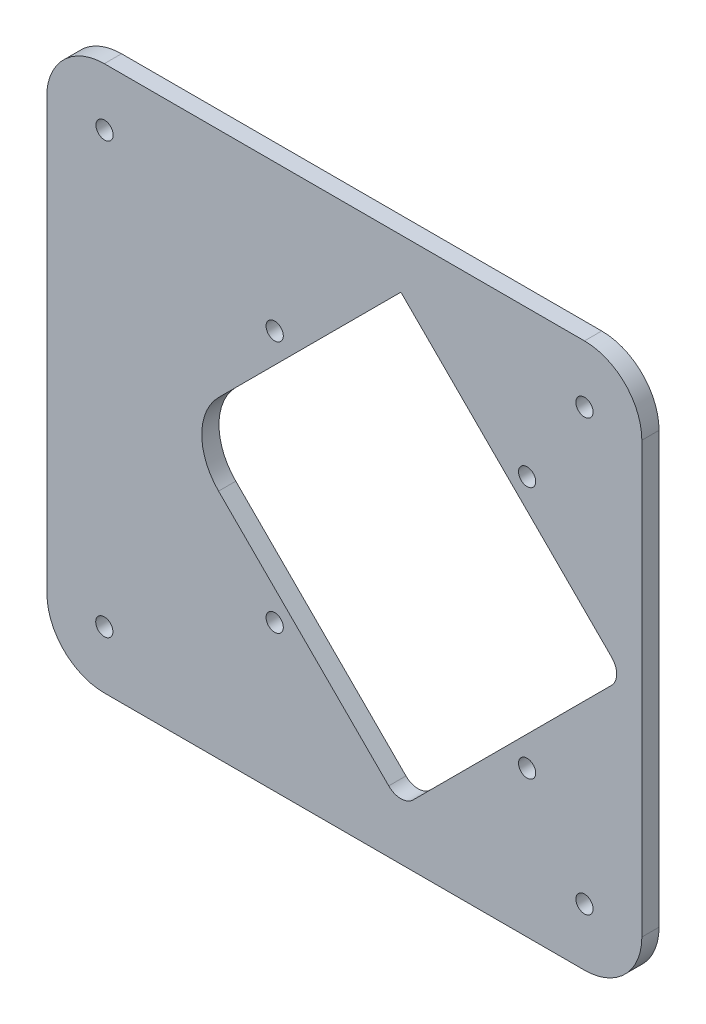
ISO-10303-21;
HEADER;
FILE_DESCRIPTION(('STEP AP214'),'2;1');
FILE_NAME('part.step','',(''),(''),'','','');
FILE_SCHEMA(('AUTOMOTIVE_DESIGN { 1 0 10303 214 1 1 1 1 }'));
ENDSEC;
DATA;
#1=APPLICATION_CONTEXT('core data for automotive mechanical design processes');
#2=APPLICATION_PROTOCOL_DEFINITION('international standard','automotive_design',2000,#1);
#3=PRODUCT_CONTEXT('',#1,'mechanical');
#4=PRODUCT('Part','Part','',(#3));
#5=PRODUCT_RELATED_PRODUCT_CATEGORY('part','',(#4));
#6=PRODUCT_DEFINITION_FORMATION('','',#4);
#7=PRODUCT_DEFINITION_CONTEXT('part definition',#1,'design');
#8=PRODUCT_DEFINITION('design','',#6,#7);
#9=PRODUCT_DEFINITION_SHAPE('','',#8);
#10=(LENGTH_UNIT() NAMED_UNIT(*) SI_UNIT(.MILLI.,.METRE.));
#11=(NAMED_UNIT(*) PLANE_ANGLE_UNIT() SI_UNIT($,.RADIAN.));
#12=(NAMED_UNIT(*) SI_UNIT($,.STERADIAN.) SOLID_ANGLE_UNIT());
#13=UNCERTAINTY_MEASURE_WITH_UNIT(LENGTH_MEASURE(1.E-05),#10,'distance_accuracy_value','');
#14=(GEOMETRIC_REPRESENTATION_CONTEXT(3) GLOBAL_UNCERTAINTY_ASSIGNED_CONTEXT((#13)) GLOBAL_UNIT_ASSIGNED_CONTEXT((#10,
#11,#12)) REPRESENTATION_CONTEXT('',''));
#15=CARTESIAN_POINT('',(0.,0.,0.));
#16=DIRECTION('',(0.,0.,1.));
#17=DIRECTION('',(1.,0.,0.));
#18=AXIS2_PLACEMENT_3D('',#15,#16,#17);
#19=CARTESIAN_POINT('',(0.,85.8158299189013,3.));
#20=DIRECTION('',(0.,-1.,0.));
#21=DIRECTION('',(1.,0.,0.));
#22=AXIS2_PLACEMENT_3D('',#19,#20,#21);
#23=PLANE('',#22);
#24=DIRECTION('',(-1.,0.,0.));
#25=VECTOR('',#24,1.);
#26=CARTESIAN_POINT('',(0.,85.8158299189013,0.));
#27=LINE('',#26,#25);
#28=CARTESIAN_POINT('',(117.267301895935,85.8158299189013,0.));
#29=VERTEX_POINT('',#28);
#30=CARTESIAN_POINT('',(33.5675872249523,85.8158299189013,0.));
#31=VERTEX_POINT('',#30);
#32=EDGE_CURVE('E226',#29,#31,#27,.T.);
#33=ORIENTED_EDGE('',*,*,#32,.T.);
#34=DIRECTION('',(0.,0.,-1.));
#35=VECTOR('',#34,1.);
#36=CARTESIAN_POINT('',(33.5675872249523,85.8158299189013,3.));
#37=LINE('',#36,#35);
#38=CARTESIAN_POINT('',(33.5675872249523,85.8158299189013,3.));
#39=VERTEX_POINT('',#38);
#40=EDGE_CURVE('E11',#39,#31,#37,.T.);
#41=ORIENTED_EDGE('',*,*,#40,.F.);
#42=DIRECTION('',(-1.,0.,0.));
#43=VECTOR('',#42,1.);
#44=CARTESIAN_POINT('',(0.,85.8158299189013,3.));
#45=LINE('',#44,#43);
#46=CARTESIAN_POINT('',(117.267301895935,85.8158299189013,3.));
#47=VERTEX_POINT('',#46);
#48=EDGE_CURVE('E324',#47,#39,#45,.T.);
#49=ORIENTED_EDGE('',*,*,#48,.F.);
#50=DIRECTION('',(0.,0.,-1.));
#51=VECTOR('',#50,1.);
#52=CARTESIAN_POINT('',(117.267301895935,85.8158299189013,3.));
#53=LINE('',#52,#51);
#54=EDGE_CURVE('E243',#47,#29,#53,.T.);
#55=ORIENTED_EDGE('',*,*,#54,.T.);
#56=EDGE_LOOP('',(#33,#41,#49,#55));
#57=FACE_BOUND('',#56,.T.);
#58=ADVANCED_FACE('F39',(#57),#23,.F.);
#59=CARTESIAN_POINT('',(33.610099884934,75.7130723533501,3.));
#60=DIRECTION('',(0.,0.,-1.));
#61=DIRECTION('',(-1.,0.,0.));
#62=AXIS2_PLACEMENT_3D('',#59,#60,#61);
#63=CYLINDRICAL_SURFACE('',#62,10.1028470123308);
#64=CARTESIAN_POINT('',(33.610099884934,75.7130723533501,0.));
#65=DIRECTION('',(0.,0.,1.));
#66=DIRECTION('',(1.,0.,0.));
#67=AXIS2_PLACEMENT_3D('',#64,#65,#66);
#68=CIRCLE('',#67,10.1028470123308);
#69=CARTESIAN_POINT('',(23.5676213144406,76.815860599452,0.));
#70=VERTEX_POINT('',#69);
#71=EDGE_CURVE('E229',#31,#70,#68,.T.);
#72=ORIENTED_EDGE('',*,*,#71,.T.);
#73=DIRECTION('',(0.,0.,-1.));
#74=VECTOR('',#73,1.);
#75=CARTESIAN_POINT('',(23.5676213144406,76.815860599452,3.));
#76=LINE('',#75,#74);
#77=CARTESIAN_POINT('',(23.5676213144406,76.815860599452,3.));
#78=VERTEX_POINT('',#77);
#79=EDGE_CURVE('E49',#78,#70,#76,.T.);
#80=ORIENTED_EDGE('',*,*,#79,.F.);
#81=CARTESIAN_POINT('',(33.610099884934,75.7130723533501,3.));
#82=DIRECTION('',(0.,0.,1.));
#83=DIRECTION('',(1.,0.,0.));
#84=AXIS2_PLACEMENT_3D('',#81,#82,#83);
#85=CIRCLE('',#84,10.1028470123308);
#86=EDGE_CURVE('E326',#39,#78,#85,.T.);
#87=ORIENTED_EDGE('',*,*,#86,.F.);
#88=ORIENTED_EDGE('',*,*,#40,.T.);
#89=EDGE_LOOP('',(#72,#80,#87,#88));
#90=FACE_BOUND('',#89,.T.);
#91=ADVANCED_FACE('F361',(#90),#63,.T.);
#92=CARTESIAN_POINT('',(23.5676213144406,0.,3.));
#93=DIRECTION('',(-1.,0.,0.));
#94=DIRECTION('',(0.,0.,1.));
#95=AXIS2_PLACEMENT_3D('',#92,#93,#94);
#96=PLANE('',#95);
#97=DIRECTION('',(0.,1.,0.));
#98=VECTOR('',#97,1.);
#99=CARTESIAN_POINT('',(23.5676213144406,0.,0.));
#100=LINE('',#99,#98);
#101=CARTESIAN_POINT('',(23.5676213144406,0.816119679548928,0.));
#102=VERTEX_POINT('',#101);
#103=EDGE_CURVE('E232',#102,#70,#100,.T.);
#104=ORIENTED_EDGE('',*,*,#103,.F.);
#105=DIRECTION('',(0.,0.,-1.));
#106=VECTOR('',#105,1.);
#107=CARTESIAN_POINT('',(23.5676213144406,0.816119679548928,3.));
#108=LINE('',#107,#106);
#109=CARTESIAN_POINT('',(23.5676213144406,0.816119679548928,3.));
#110=VERTEX_POINT('',#109);
#111=EDGE_CURVE('E250',#110,#102,#108,.T.);
#112=ORIENTED_EDGE('',*,*,#111,.F.);
#113=DIRECTION('',(0.,1.,0.));
#114=VECTOR('',#113,1.);
#115=CARTESIAN_POINT('',(23.5676213144406,0.,3.));
#116=LINE('',#115,#114);
#117=EDGE_CURVE('E328',#110,#78,#116,.T.);
#118=ORIENTED_EDGE('',*,*,#117,.T.);
#119=ORIENTED_EDGE('',*,*,#79,.T.);
#120=EDGE_LOOP('',(#104,#112,#118,#119));
#121=FACE_BOUND('',#120,.T.);
#122=ADVANCED_FACE('F366',(#121),#96,.T.);
#123=CARTESIAN_POINT('',(33.5676480380997,0.816180492699436,3.));
#124=DIRECTION('',(0.,0.,-1.));
#125=DIRECTION('',(-1.,0.,0.));
#126=AXIS2_PLACEMENT_3D('',#123,#124,#125);
#127=CYLINDRICAL_SURFACE('',#126,10.000026723844);
#128=CARTESIAN_POINT('',(33.5676480380997,0.816180492699436,0.));
#129=DIRECTION('',(0.,0.,1.));
#130=DIRECTION('',(1.,0.,0.));
#131=AXIS2_PLACEMENT_3D('',#128,#129,#130);
#132=CIRCLE('',#131,10.000026723844);
#133=CARTESIAN_POINT('',(33.5676480380997,-9.18384623114456,0.));
#134=VERTEX_POINT('',#133);
#135=EDGE_CURVE('E235',#102,#134,#132,.T.);
#136=ORIENTED_EDGE('',*,*,#135,.T.);
#137=DIRECTION('',(0.,0.,-1.));
#138=VECTOR('',#137,1.);
#139=CARTESIAN_POINT('',(33.5676480380997,-9.18384623114456,3.));
#140=LINE('',#139,#138);
#141=CARTESIAN_POINT('',(33.5676480380997,-9.18384623114456,3.));
#142=VERTEX_POINT('',#141);
#143=EDGE_CURVE('E247',#142,#134,#140,.T.);
#144=ORIENTED_EDGE('',*,*,#143,.F.);
#145=CARTESIAN_POINT('',(33.5676480380997,0.816180492699436,3.));
#146=DIRECTION('',(0.,0.,1.));
#147=DIRECTION('',(1.,0.,0.));
#148=AXIS2_PLACEMENT_3D('',#145,#146,#147);
#149=CIRCLE('',#148,10.000026723844);
#150=EDGE_CURVE('E331',#110,#142,#149,.T.);
#151=ORIENTED_EDGE('',*,*,#150,.F.);
#152=ORIENTED_EDGE('',*,*,#111,.T.);
#153=EDGE_LOOP('',(#136,#144,#151,#152));
#154=FACE_BOUND('',#153,.T.);
#155=ADVANCED_FACE('F336',(#154),#127,.T.);
#156=CARTESIAN_POINT('',(0.,-9.18384623114454,3.));
#157=DIRECTION('',(0.,1.,0.));
#158=DIRECTION('',(-1.,0.,0.));
#159=AXIS2_PLACEMENT_3D('',#156,#157,#158);
#160=PLANE('',#159);
#161=DIRECTION('',(1.,0.,0.));
#162=VECTOR('',#161,1.);
#163=CARTESIAN_POINT('',(0.,-9.18384623114454,0.));
#164=LINE('',#163,#162);
#165=CARTESIAN_POINT('',(117.267301895935,-9.1838462311446,0.));
#166=VERTEX_POINT('',#165);
#167=EDGE_CURVE('E237',#134,#166,#164,.T.);
#168=ORIENTED_EDGE('',*,*,#167,.T.);
#169=DIRECTION('',(0.,0.,-1.));
#170=VECTOR('',#169,1.);
#171=CARTESIAN_POINT('',(117.267301895935,-9.1838462311446,3.));
#172=LINE('',#171,#170);
#173=CARTESIAN_POINT('',(117.267301895935,-9.1838462311446,3.));
#174=VERTEX_POINT('',#173);
#175=EDGE_CURVE('E172',#174,#166,#172,.T.);
#176=ORIENTED_EDGE('',*,*,#175,.F.);
#177=DIRECTION('',(1.,0.,0.));
#178=VECTOR('',#177,1.);
#179=CARTESIAN_POINT('',(0.,-9.18384623114454,3.));
#180=LINE('',#179,#178);
#181=EDGE_CURVE('E163',#142,#174,#180,.T.);
#182=ORIENTED_EDGE('',*,*,#181,.F.);
#183=ORIENTED_EDGE('',*,*,#143,.T.);
#184=EDGE_LOOP('',(#168,#176,#182,#183));
#185=FACE_BOUND('',#184,.T.);
#186=ADVANCED_FACE('F340',(#185),#160,.F.);
#187=CARTESIAN_POINT('',(117.267226437662,0.816095137726306,3.));
#188=DIRECTION('',(0.,0.,-1.));
#189=DIRECTION('',(-1.,0.,0.));
#190=AXIS2_PLACEMENT_3D('',#187,#188,#189);
#191=CYLINDRICAL_SURFACE('',#190,9.99994136915558);
#192=CARTESIAN_POINT('',(117.267226437662,0.816095137726306,0.));
#193=DIRECTION('',(0.,0.,1.));
#194=DIRECTION('',(1.,0.,0.));
#195=AXIS2_PLACEMENT_3D('',#192,#193,#194);
#196=CIRCLE('',#195,9.99994136915558);
#197=CARTESIAN_POINT('',(127.267167806788,0.816119679301803,0.));
#198=VERTEX_POINT('',#197);
#199=EDGE_CURVE('E171',#166,#198,#196,.T.);
#200=ORIENTED_EDGE('',*,*,#199,.T.);
#201=DIRECTION('',(0.,0.,-1.));
#202=VECTOR('',#201,1.);
#203=CARTESIAN_POINT('',(127.267167806788,0.816119679301803,3.));
#204=LINE('',#203,#202);
#205=CARTESIAN_POINT('',(127.267167806788,0.816119679301803,3.));
#206=VERTEX_POINT('',#205);
#207=EDGE_CURVE('E168',#206,#198,#204,.T.);
#208=ORIENTED_EDGE('',*,*,#207,.F.);
#209=CARTESIAN_POINT('',(117.267226437662,0.816095137726306,3.));
#210=DIRECTION('',(0.,0.,1.));
#211=DIRECTION('',(1.,0.,0.));
#212=AXIS2_PLACEMENT_3D('',#209,#210,#211);
#213=CIRCLE('',#212,9.99994136915558);
#214=EDGE_CURVE('E157',#174,#206,#213,.T.);
#215=ORIENTED_EDGE('',*,*,#214,.F.);
#216=ORIENTED_EDGE('',*,*,#175,.T.);
#217=EDGE_LOOP('',(#200,#208,#215,#216));
#218=FACE_BOUND('',#217,.T.);
#219=ADVANCED_FACE('F169',(#218),#191,.T.);
#220=CARTESIAN_POINT('',(127.267167806788,0.,3.));
#221=DIRECTION('',(-1.,0.,0.));
#222=DIRECTION('',(0.,0.,1.));
#223=AXIS2_PLACEMENT_3D('',#220,#221,#222);
#224=PLANE('',#223);
#225=DIRECTION('',(0.,1.,0.));
#226=VECTOR('',#225,1.);
#227=CARTESIAN_POINT('',(127.267167806788,0.,0.));
#228=LINE('',#227,#226);
#229=CARTESIAN_POINT('',(127.267167806788,75.8158640080907,0.));
#230=VERTEX_POINT('',#229);
#231=EDGE_CURVE('E108',#198,#230,#228,.T.);
#232=ORIENTED_EDGE('',*,*,#231,.T.);
#233=DIRECTION('',(0.,0.,-1.));
#234=VECTOR('',#233,1.);
#235=CARTESIAN_POINT('',(127.267167806788,75.8158640080907,3.));
#236=LINE('',#235,#234);
#237=CARTESIAN_POINT('',(127.267167806788,75.8158640080907,3.));
#238=VERTEX_POINT('',#237);
#239=EDGE_CURVE('E173',#238,#230,#236,.T.);
#240=ORIENTED_EDGE('',*,*,#239,.F.);
#241=DIRECTION('',(0.,1.,0.));
#242=VECTOR('',#241,1.);
#243=CARTESIAN_POINT('',(127.267167806788,0.,3.));
#244=LINE('',#243,#242);
#245=EDGE_CURVE('E161',#206,#238,#244,.T.);
#246=ORIENTED_EDGE('',*,*,#245,.F.);
#247=ORIENTED_EDGE('',*,*,#207,.T.);
#248=EDGE_LOOP('',(#232,#240,#246,#247));
#249=FACE_BOUND('',#248,.T.);
#250=ADVANCED_FACE('F175',(#249),#224,.F.);
#251=CARTESIAN_POINT('',(60.5543400223785,38.3163723805526,3.));
#252=DIRECTION('',(0.,0.,-1.));
#253=DIRECTION('',(-1.,0.,0.));
#254=AXIS2_PLACEMENT_3D('',#251,#252,#253);
#255=CYLINDRICAL_SURFACE('',#254,9.99996591051167);
#256=CARTESIAN_POINT('',(60.5543400223785,38.3163723805526,0.));
#257=DIRECTION('',(0.,0.,1.));
#258=DIRECTION('',(1.,0.,0.));
#259=AXIS2_PLACEMENT_3D('',#256,#257,#258);
#260=CIRCLE('',#259,9.99996591051167);
#261=CARTESIAN_POINT('',(53.4832849518152,45.3874047238853,0.));
#262=VERTEX_POINT('',#261);
#263=CARTESIAN_POINT('',(53.4832849518152,31.2453400372199,0.));
#264=VERTEX_POINT('',#263);
#265=EDGE_CURVE('E181',#262,#264,#260,.T.);
#266=ORIENTED_EDGE('',*,*,#265,.F.);
#267=DIRECTION('',(0.,0.,-1.));
#268=VECTOR('',#267,1.);
#269=CARTESIAN_POINT('',(53.4832849518152,45.3874047238853,3.));
#270=LINE('',#269,#268);
#271=CARTESIAN_POINT('',(53.4832849518152,45.3874047238853,3.));
#272=VERTEX_POINT('',#271);
#273=EDGE_CURVE('E43',#272,#262,#270,.T.);
#274=ORIENTED_EDGE('',*,*,#273,.F.);
#275=CARTESIAN_POINT('',(60.5543400223785,38.3163723805526,3.));
#276=DIRECTION('',(0.,0.,1.));
#277=DIRECTION('',(1.,0.,0.));
#278=AXIS2_PLACEMENT_3D('',#275,#276,#277);
#279=CIRCLE('',#278,9.99996591051167);
#280=CARTESIAN_POINT('',(53.4832849518152,31.2453400372199,3.));
#281=VERTEX_POINT('',#280);
#282=EDGE_CURVE('E242',#272,#281,#279,.T.);
#283=ORIENTED_EDGE('',*,*,#282,.T.);
#284=DIRECTION('',(0.,0.,-1.));
#285=VECTOR('',#284,1.);
#286=CARTESIAN_POINT('',(53.4832849518152,31.2453400372199,3.));
#287=LINE('',#286,#285);
#288=EDGE_CURVE('E177',#281,#264,#287,.T.);
#289=ORIENTED_EDGE('',*,*,#288,.T.);
#290=EDGE_LOOP('',(#266,#274,#283,#289));
#291=FACE_BOUND('',#290,.T.);
#292=ADVANCED_FACE('F41',(#291),#255,.F.);
#293=CARTESIAN_POINT('',(4.04802606510993,-4.04801305426208,3.));
#294=DIRECTION('',(0.707107917551036,-0.707105644820233,0.));
#295=DIRECTION('',(0.707105644820233,0.707107917551036,0.));
#296=AXIS2_PLACEMENT_3D('',#293,#294,#295);
#297=PLANE('',#296);
#298=DIRECTION('',(-0.707105644820233,-0.707107917551036,0.));
#299=VECTOR('',#298,1.);
#300=CARTESIAN_POINT('',(4.04802606510993,-4.04801305426208,0.));
#301=LINE('',#300,#299);
#302=CARTESIAN_POINT('',(85.2674242155602,77.1716461460461,0.));
#303=VERTEX_POINT('',#302);
#304=EDGE_CURVE('E184',#303,#262,#301,.T.);
#305=ORIENTED_EDGE('',*,*,#304,.F.);
#306=DIRECTION('',(0.,0.,-1.));
#307=VECTOR('',#306,1.);
#308=CARTESIAN_POINT('',(85.2674242155602,77.1716461460461,3.));
#309=LINE('',#308,#307);
#310=CARTESIAN_POINT('',(85.2674242155602,77.1716461460461,3.));
#311=VERTEX_POINT('',#310);
#312=EDGE_CURVE('E261',#311,#303,#309,.T.);
#313=ORIENTED_EDGE('',*,*,#312,.F.);
#314=DIRECTION('',(-0.707105644820233,-0.707107917551036,0.));
#315=VECTOR('',#314,1.);
#316=CARTESIAN_POINT('',(4.04802606510993,-4.04801305426208,3.));
#317=LINE('',#316,#315);
#318=EDGE_CURVE('E270',#311,#272,#317,.T.);
#319=ORIENTED_EDGE('',*,*,#318,.T.);
#320=ORIENTED_EDGE('',*,*,#273,.T.);
#321=EDGE_LOOP('',(#305,#313,#319,#320));
#322=FACE_BOUND('',#321,.T.);
#323=ADVANCED_FACE('F268',(#322),#297,.T.);
#324=CARTESIAN_POINT('',(81.2195351808036,81.2195351808028,3.));
#325=DIRECTION('',(-0.707106781186551,-0.707106781186544,0.));
#326=DIRECTION('',(0.707106781186544,-0.707106781186551,0.));
#327=AXIS2_PLACEMENT_3D('',#324,#325,#326);
#328=PLANE('',#327);
#329=DIRECTION('',(-0.707106781186544,0.707106781186551,0.));
#330=VECTOR('',#329,1.);
#331=CARTESIAN_POINT('',(81.2195351808036,81.2195351808028,0.));
#332=LINE('',#331,#330);
#333=CARTESIAN_POINT('',(122.001384868967,40.4376854926398,0.));
#334=VERTEX_POINT('',#333);
#335=EDGE_CURVE('E187',#334,#303,#332,.T.);
#336=ORIENTED_EDGE('',*,*,#335,.F.);
#337=DIRECTION('',(0.,0.,-1.));
#338=VECTOR('',#337,1.);
#339=CARTESIAN_POINT('',(122.001384868967,40.4376854926398,3.));
#340=LINE('',#339,#338);
#341=CARTESIAN_POINT('',(122.001384868967,40.4376854926398,3.));
#342=VERTEX_POINT('',#341);
#343=EDGE_CURVE('E260',#342,#334,#340,.T.);
#344=ORIENTED_EDGE('',*,*,#343,.F.);
#345=DIRECTION('',(-0.707106781186544,0.707106781186551,0.));
#346=VECTOR('',#345,1.);
#347=CARTESIAN_POINT('',(81.2195351808036,81.2195351808028,3.));
#348=LINE('',#347,#346);
#349=EDGE_CURVE('E278',#342,#311,#348,.T.);
#350=ORIENTED_EDGE('',*,*,#349,.T.);
#351=ORIENTED_EDGE('',*,*,#312,.T.);
#352=EDGE_LOOP('',(#336,#344,#350,#351));
#353=FACE_BOUND('',#352,.T.);
#354=ADVANCED_FACE('F276',(#353),#328,.T.);
#355=CARTESIAN_POINT('',(119.880071756879,38.3163723805526,3.));
#356=DIRECTION('',(0.,0.,-1.));
#357=DIRECTION('',(-1.,0.,0.));
#358=AXIS2_PLACEMENT_3D('',#355,#356,#357);
#359=CYLINDRICAL_SURFACE('',#358,2.99998977315351);
#360=CARTESIAN_POINT('',(119.880071756879,38.3163723805526,0.));
#361=DIRECTION('',(0.,0.,1.));
#362=DIRECTION('',(1.,0.,0.));
#363=AXIS2_PLACEMENT_3D('',#360,#361,#362);
#364=CIRCLE('',#363,2.99998977315351);
#365=CARTESIAN_POINT('',(122.001384868967,36.1950592684655,0.));
#366=VERTEX_POINT('',#365);
#367=EDGE_CURVE('E190',#366,#334,#364,.T.);
#368=ORIENTED_EDGE('',*,*,#367,.F.);
#369=DIRECTION('',(0.,0.,-1.));
#370=VECTOR('',#369,1.);
#371=CARTESIAN_POINT('',(122.001384868967,36.1950592684655,3.));
#372=LINE('',#371,#370);
#373=CARTESIAN_POINT('',(122.001384868967,36.1950592684655,3.));
#374=VERTEX_POINT('',#373);
#375=EDGE_CURVE('E258',#374,#366,#372,.T.);
#376=ORIENTED_EDGE('',*,*,#375,.F.);
#377=CARTESIAN_POINT('',(119.880071756879,38.3163723805526,3.));
#378=DIRECTION('',(0.,0.,1.));
#379=DIRECTION('',(1.,0.,0.));
#380=AXIS2_PLACEMENT_3D('',#377,#378,#379);
#381=CIRCLE('',#380,2.99998977315351);
#382=EDGE_CURVE('E285',#374,#342,#381,.T.);
#383=ORIENTED_EDGE('',*,*,#382,.T.);
#384=ORIENTED_EDGE('',*,*,#343,.T.);
#385=EDGE_LOOP('',(#368,#376,#383,#384));
#386=FACE_BOUND('',#385,.T.);
#387=ADVANCED_FACE('F288',(#386),#359,.F.);
#388=CARTESIAN_POINT('',(42.9031628002506,-42.9031628002505,3.));
#389=DIRECTION('',(-0.707106781186548,0.707106781186547,0.));
#390=DIRECTION('',(-0.707106781186547,-0.707106781186548,0.));
#391=AXIS2_PLACEMENT_3D('',#388,#389,#390);
#392=PLANE('',#391);
#393=DIRECTION('',(0.707106781186547,0.707106781186548,0.));
#394=VECTOR('',#393,1.);
#395=CARTESIAN_POINT('',(42.9031628002506,-42.9031628002505,0.));
#396=LINE('',#395,#394);
#397=CARTESIAN_POINT('',(87.3887407367347,1.58241513623365,0.));
#398=VERTEX_POINT('',#397);
#399=EDGE_CURVE('E193',#398,#366,#396,.T.);
#400=ORIENTED_EDGE('',*,*,#399,.F.);
#401=DIRECTION('',(0.,0.,-1.));
#402=VECTOR('',#401,1.);
#403=CARTESIAN_POINT('',(87.3887407367347,1.58241513623365,3.));
#404=LINE('',#403,#402);
#405=CARTESIAN_POINT('',(87.3887407367347,1.58241513623365,3.));
#406=VERTEX_POINT('',#405);
#407=EDGE_CURVE('E256',#406,#398,#404,.T.);
#408=ORIENTED_EDGE('',*,*,#407,.F.);
#409=DIRECTION('',(0.707106781186547,0.707106781186548,0.));
#410=VECTOR('',#409,1.);
#411=CARTESIAN_POINT('',(42.9031628002506,-42.9031628002505,3.));
#412=LINE('',#411,#410);
#413=EDGE_CURVE('E289',#406,#374,#412,.T.);
#414=ORIENTED_EDGE('',*,*,#413,.T.);
#415=ORIENTED_EDGE('',*,*,#375,.T.);
#416=EDGE_LOOP('',(#400,#408,#414,#415));
#417=FACE_BOUND('',#416,.T.);
#418=ADVANCED_FACE('F405',(#417),#392,.T.);
#419=CARTESIAN_POINT('',(85.2674276246476,3.70372824832079,3.));
#420=DIRECTION('',(0.,0.,-1.));
#421=DIRECTION('',(-1.,0.,0.));
#422=AXIS2_PLACEMENT_3D('',#419,#420,#421);
#423=CYLINDRICAL_SURFACE('',#422,2.99998977315355);
#424=CARTESIAN_POINT('',(85.2674276246476,3.70372824832079,0.));
#425=DIRECTION('',(0.,0.,1.));
#426=DIRECTION('',(1.,0.,0.));
#427=AXIS2_PLACEMENT_3D('',#424,#425,#426);
#428=CIRCLE('',#427,2.99998977315355);
#429=CARTESIAN_POINT('',(83.1461111034786,1.58241854532088,0.));
#430=VERTEX_POINT('',#429);
#431=EDGE_CURVE('E196',#430,#398,#428,.T.);
#432=ORIENTED_EDGE('',*,*,#431,.F.);
#433=DIRECTION('',(0.,0.,-1.));
#434=VECTOR('',#433,1.);
#435=CARTESIAN_POINT('',(83.1461111034786,1.58241854532088,3.));
#436=LINE('',#435,#434);
#437=CARTESIAN_POINT('',(83.1461111034786,1.58241854532088,3.));
#438=VERTEX_POINT('',#437);
#439=EDGE_CURVE('E254',#438,#430,#436,.T.);
#440=ORIENTED_EDGE('',*,*,#439,.F.);
#441=CARTESIAN_POINT('',(85.2674276246476,3.70372824832079,3.));
#442=DIRECTION('',(0.,0.,1.));
#443=DIRECTION('',(1.,0.,0.));
#444=AXIS2_PLACEMENT_3D('',#441,#442,#443);
#445=CIRCLE('',#444,2.99998977315355);
#446=EDGE_CURVE('E291',#438,#406,#445,.T.);
#447=ORIENTED_EDGE('',*,*,#446,.T.);
#448=ORIENTED_EDGE('',*,*,#407,.T.);
#449=EDGE_LOOP('',(#432,#440,#447,#448));
#450=FACE_BOUND('',#449,.T.);
#451=ADVANCED_FACE('F375',(#450),#423,.F.);
#452=CARTESIAN_POINT('',(107.267555430377,60.3157973913478,3.));
#453=DIRECTION('',(0.,0.,-1.));
#454=DIRECTION('',(-1.,0.,0.));
#455=AXIS2_PLACEMENT_3D('',#452,#453,#454);
#456=CYLINDRICAL_SURFACE('',#455,1.49999488657675);
#457=CARTESIAN_POINT('',(107.267555430377,60.3157973913478,3.));
#458=DIRECTION('',(0.,0.,1.));
#459=DIRECTION('',(1.,0.,0.));
#460=AXIS2_PLACEMENT_3D('',#457,#458,#459);
#461=CIRCLE('',#460,1.49999488657675);
#462=CARTESIAN_POINT('',(108.767550316954,60.3157973913478,3.));
#463=VERTEX_POINT('',#462);
#464=EDGE_CURVE('E321',#463,#463,#461,.T.);
#465=ORIENTED_EDGE('',*,*,#464,.T.);
#466=EDGE_LOOP('',(#465));
#467=FACE_BOUND('',#466,.T.);
#468=CARTESIAN_POINT('',(107.267555430377,60.3157973913478,0.));
#469=DIRECTION('',(0.,0.,1.));
#470=DIRECTION('',(1.,0.,0.));
#471=AXIS2_PLACEMENT_3D('',#468,#469,#470);
#472=CIRCLE('',#471,1.49999488657675);
#473=CARTESIAN_POINT('',(108.767550316954,60.3157973913478,0.));
#474=VERTEX_POINT('',#473);
#475=EDGE_CURVE('E223',#474,#474,#472,.T.);
#476=ORIENTED_EDGE('',*,*,#475,.F.);
#477=EDGE_LOOP('',(#476));
#478=FACE_BOUND('',#477,.T.);
#479=ADVANCED_FACE('F371',(#467,#478),#456,.F.);
#480=CARTESIAN_POINT('',(63.267555430633,60.3159473886347,3.));
#481=DIRECTION('',(0.,0.,-1.));
#482=DIRECTION('',(-1.,0.,0.));
#483=AXIS2_PLACEMENT_3D('',#480,#481,#482);
#484=CYLINDRICAL_SURFACE('',#483,1.49999488657675);
#485=CARTESIAN_POINT('',(63.267555430633,60.3159473886347,3.));
#486=DIRECTION('',(0.,0.,1.));
#487=DIRECTION('',(1.,0.,0.));
#488=AXIS2_PLACEMENT_3D('',#485,#486,#487);
#489=CIRCLE('',#488,1.49999488657675);
#490=CARTESIAN_POINT('',(64.7675503172097,60.3159473886347,3.));
#491=VERTEX_POINT('',#490);
#492=EDGE_CURVE('E318',#491,#491,#489,.T.);
#493=ORIENTED_EDGE('',*,*,#492,.T.);
#494=EDGE_LOOP('',(#493));
#495=FACE_BOUND('',#494,.T.);
#496=CARTESIAN_POINT('',(63.267555430633,60.3159473886347,0.));
#497=DIRECTION('',(0.,0.,1.));
#498=DIRECTION('',(1.,0.,0.));
#499=AXIS2_PLACEMENT_3D('',#496,#497,#498);
#500=CIRCLE('',#499,1.49999488657675);
#501=CARTESIAN_POINT('',(64.7675503172097,60.3159473886347,0.));
#502=VERTEX_POINT('',#501);
#503=EDGE_CURVE('E220',#502,#502,#500,.T.);
#504=ORIENTED_EDGE('',*,*,#503,.F.);
#505=EDGE_LOOP('',(#504));
#506=FACE_BOUND('',#505,.T.);
#507=ADVANCED_FACE('F374',(#495,#506),#484,.F.);
#508=CARTESIAN_POINT('',(107.267555430377,16.3159473886631,3.));
#509=DIRECTION('',(0.,0.,-1.));
#510=DIRECTION('',(-1.,0.,0.));
#511=AXIS2_PLACEMENT_3D('',#508,#509,#510);
#512=CYLINDRICAL_SURFACE('',#511,1.49999488657675);
#513=CARTESIAN_POINT('',(107.267555430377,16.3159473886631,3.));
#514=DIRECTION('',(0.,0.,1.));
#515=DIRECTION('',(1.,0.,0.));
#516=AXIS2_PLACEMENT_3D('',#513,#514,#515);
#517=CIRCLE('',#516,1.49999488657675);
#518=CARTESIAN_POINT('',(108.767550316954,16.3159473886631,3.));
#519=VERTEX_POINT('',#518);
#520=EDGE_CURVE('E315',#519,#519,#517,.T.);
#521=ORIENTED_EDGE('',*,*,#520,.T.);
#522=EDGE_LOOP('',(#521));
#523=FACE_BOUND('',#522,.T.);
#524=CARTESIAN_POINT('',(107.267555430377,16.3159473886631,0.));
#525=DIRECTION('',(0.,0.,1.));
#526=DIRECTION('',(1.,0.,0.));
#527=AXIS2_PLACEMENT_3D('',#524,#525,#526);
#528=CIRCLE('',#527,1.49999488657675);
#529=CARTESIAN_POINT('',(108.767550316954,16.3159473886631,0.));
#530=VERTEX_POINT('',#529);
#531=EDGE_CURVE('E217',#530,#530,#528,.T.);
#532=ORIENTED_EDGE('',*,*,#531,.F.);
#533=EDGE_LOOP('',(#532));
#534=FACE_BOUND('',#533,.T.);
#535=ADVANCED_FACE('F379',(#523,#534),#512,.F.);
#536=CARTESIAN_POINT('',(33.5675872249522,0.816119679367116,3.));
#537=DIRECTION('',(0.,0.,-1.));
#538=DIRECTION('',(-1.,0.,0.));
#539=AXIS2_PLACEMENT_3D('',#536,#537,#538);
#540=CYLINDRICAL_SURFACE('',#539,1.49999488657676);
#541=CARTESIAN_POINT('',(33.5675872249522,0.816119679367116,3.));
#542=DIRECTION('',(0.,0.,1.));
#543=DIRECTION('',(1.,0.,0.));
#544=AXIS2_PLACEMENT_3D('',#541,#542,#543);
#545=CIRCLE('',#544,1.49999488657676);
#546=CARTESIAN_POINT('',(35.067582111529,0.816119679367116,3.));
#547=VERTEX_POINT('',#546);
#548=EDGE_CURVE('E312',#547,#547,#545,.T.);
#549=ORIENTED_EDGE('',*,*,#548,.T.);
#550=EDGE_LOOP('',(#549));
#551=FACE_BOUND('',#550,.T.);
#552=CARTESIAN_POINT('',(33.5675872249522,0.816119679367116,0.));
#553=DIRECTION('',(0.,0.,1.));
#554=DIRECTION('',(1.,0.,0.));
#555=AXIS2_PLACEMENT_3D('',#552,#553,#554);
#556=CIRCLE('',#555,1.49999488657676);
#557=CARTESIAN_POINT('',(35.067582111529,0.816119679367116,0.));
#558=VERTEX_POINT('',#557);
#559=EDGE_CURVE('E214',#558,#558,#556,.T.);
#560=ORIENTED_EDGE('',*,*,#559,.F.);
#561=EDGE_LOOP('',(#560));
#562=FACE_BOUND('',#561,.T.);
#563=ADVANCED_FACE('F383',(#551,#562),#540,.F.);
#564=CARTESIAN_POINT('',(33.6100390717867,75.8158640082047,3.));
#565=DIRECTION('',(0.,0.,-1.));
#566=DIRECTION('',(-1.,0.,0.));
#567=AXIS2_PLACEMENT_3D('',#564,#565,#566);
#568=CYLINDRICAL_SURFACE('',#567,1.49999488657675);
#569=CARTESIAN_POINT('',(33.6100390717867,75.8158640082047,3.));
#570=DIRECTION('',(0.,0.,1.));
#571=DIRECTION('',(1.,0.,0.));
#572=AXIS2_PLACEMENT_3D('',#569,#570,#571);
#573=CIRCLE('',#572,1.49999488657675);
#574=CARTESIAN_POINT('',(35.1100339583634,75.8158640082047,3.));
#575=VERTEX_POINT('',#574);
#576=EDGE_CURVE('E309',#575,#575,#573,.T.);
#577=ORIENTED_EDGE('',*,*,#576,.T.);
#578=EDGE_LOOP('',(#577));
#579=FACE_BOUND('',#578,.T.);
#580=CARTESIAN_POINT('',(33.6100390717867,75.8158640082047,0.));
#581=DIRECTION('',(0.,0.,1.));
#582=DIRECTION('',(1.,0.,0.));
#583=AXIS2_PLACEMENT_3D('',#580,#581,#582);
#584=CIRCLE('',#583,1.49999488657675);
#585=CARTESIAN_POINT('',(35.1100339583634,75.8158640082047,0.));
#586=VERTEX_POINT('',#585);
#587=EDGE_CURVE('E211',#586,#586,#584,.T.);
#588=ORIENTED_EDGE('',*,*,#587,.F.);
#589=EDGE_LOOP('',(#588));
#590=FACE_BOUND('',#589,.T.);
#591=ADVANCED_FACE('F387',(#579,#590),#568,.F.);
#592=CARTESIAN_POINT('',(117.267226437662,0.816095137726306,3.));
#593=DIRECTION('',(0.,0.,-1.));
#594=DIRECTION('',(-1.,0.,0.));
#595=AXIS2_PLACEMENT_3D('',#592,#593,#594);
#596=CYLINDRICAL_SURFACE('',#595,1.49999488657675);
#597=CARTESIAN_POINT('',(117.267226437662,0.816095137726306,3.));
#598=DIRECTION('',(0.,0.,1.));
#599=DIRECTION('',(1.,0.,0.));
#600=AXIS2_PLACEMENT_3D('',#597,#598,#599);
#601=CIRCLE('',#600,1.49999488657675);
#602=CARTESIAN_POINT('',(118.767221324239,0.816095137726306,3.));
#603=VERTEX_POINT('',#602);
#604=EDGE_CURVE('E306',#603,#603,#601,.T.);
#605=ORIENTED_EDGE('',*,*,#604,.T.);
#606=EDGE_LOOP('',(#605));
#607=FACE_BOUND('',#606,.T.);
#608=CARTESIAN_POINT('',(117.267226437662,0.816095137726306,0.));
#609=DIRECTION('',(0.,0.,1.));
#610=DIRECTION('',(1.,0.,0.));
#611=AXIS2_PLACEMENT_3D('',#608,#609,#610);
#612=CIRCLE('',#611,1.49999488657675);
#613=CARTESIAN_POINT('',(118.767221324239,0.816095137726306,0.));
#614=VERTEX_POINT('',#613);
#615=EDGE_CURVE('E208',#614,#614,#612,.T.);
#616=ORIENTED_EDGE('',*,*,#615,.F.);
#617=EDGE_LOOP('',(#616));
#618=FACE_BOUND('',#617,.T.);
#619=ADVANCED_FACE('F391',(#607,#618),#596,.F.);
#620=CARTESIAN_POINT('',(117.267226437662,75.8158640082047,3.));
#621=DIRECTION('',(0.,0.,-1.));
#622=DIRECTION('',(-1.,0.,0.));
#623=AXIS2_PLACEMENT_3D('',#620,#621,#622);
#624=CYLINDRICAL_SURFACE('',#623,1.49999488657675);
#625=CARTESIAN_POINT('',(117.267226437662,75.8158640082047,3.));
#626=DIRECTION('',(0.,0.,1.));
#627=DIRECTION('',(1.,0.,0.));
#628=AXIS2_PLACEMENT_3D('',#625,#626,#627);
#629=CIRCLE('',#628,1.49999488657675);
#630=CARTESIAN_POINT('',(118.767221324239,75.8158640082047,3.));
#631=VERTEX_POINT('',#630);
#632=EDGE_CURVE('E303',#631,#631,#629,.T.);
#633=ORIENTED_EDGE('',*,*,#632,.T.);
#634=EDGE_LOOP('',(#633));
#635=FACE_BOUND('',#634,.T.);
#636=CARTESIAN_POINT('',(117.267226437662,75.8158640082047,0.));
#637=DIRECTION('',(0.,0.,1.));
#638=DIRECTION('',(1.,0.,0.));
#639=AXIS2_PLACEMENT_3D('',#636,#637,#638);
#640=CIRCLE('',#639,1.49999488657675);
#641=CARTESIAN_POINT('',(118.767221324239,75.8158640082047,0.));
#642=VERTEX_POINT('',#641);
#643=EDGE_CURVE('E205',#642,#642,#640,.T.);
#644=ORIENTED_EDGE('',*,*,#643,.F.);
#645=EDGE_LOOP('',(#644));
#646=FACE_BOUND('',#645,.T.);
#647=ADVANCED_FACE('F395',(#635,#646),#624,.F.);
#648=CARTESIAN_POINT('',(63.2676054323855,16.3159473886631,3.));
#649=DIRECTION('',(0.,0.,-1.));
#650=DIRECTION('',(-1.,0.,0.));
#651=AXIS2_PLACEMENT_3D('',#648,#649,#650);
#652=CYLINDRICAL_SURFACE('',#651,1.49999488657675);
#653=CARTESIAN_POINT('',(63.2676054323855,16.3159473886631,3.));
#654=DIRECTION('',(0.,0.,1.));
#655=DIRECTION('',(1.,0.,0.));
#656=AXIS2_PLACEMENT_3D('',#653,#654,#655);
#657=CIRCLE('',#656,1.49999488657675);
#658=CARTESIAN_POINT('',(64.7676003189623,16.3159473886631,3.));
#659=VERTEX_POINT('',#658);
#660=EDGE_CURVE('E300',#659,#659,#657,.T.);
#661=ORIENTED_EDGE('',*,*,#660,.T.);
#662=EDGE_LOOP('',(#661));
#663=FACE_BOUND('',#662,.T.);
#664=CARTESIAN_POINT('',(63.2676054323855,16.3159473886631,0.));
#665=DIRECTION('',(0.,0.,1.));
#666=DIRECTION('',(1.,0.,0.));
#667=AXIS2_PLACEMENT_3D('',#664,#665,#666);
#668=CIRCLE('',#667,1.49999488657675);
#669=CARTESIAN_POINT('',(64.7676003189623,16.3159473886631,0.));
#670=VERTEX_POINT('',#669);
#671=EDGE_CURVE('E202',#670,#670,#668,.T.);
#672=ORIENTED_EDGE('',*,*,#671,.F.);
#673=EDGE_LOOP('',(#672));
#674=FACE_BOUND('',#673,.T.);
#675=ADVANCED_FACE('F355',(#663,#674),#652,.F.);
#676=CARTESIAN_POINT('',(42.3643984454647,42.3642622811381,3.));
#677=DIRECTION('',(0.707107917551037,0.707105644820231,0.));
#678=DIRECTION('',(-0.707105644820231,0.707107917551038,0.));
#679=AXIS2_PLACEMENT_3D('',#676,#677,#678);
#680=PLANE('',#679);
#681=DIRECTION('',(0.707105644820232,-0.707107917551038,0.));
#682=VECTOR('',#681,1.);
#683=CARTESIAN_POINT('',(42.3643984454647,42.3642622811381,0.));
#684=LINE('',#683,#682);
#685=EDGE_CURVE('E199',#264,#430,#684,.T.);
#686=ORIENTED_EDGE('',*,*,#685,.F.);
#687=ORIENTED_EDGE('',*,*,#288,.F.);
#688=DIRECTION('',(0.707105644820232,-0.707107917551038,0.));
#689=VECTOR('',#688,1.);
#690=CARTESIAN_POINT('',(42.3643984454647,42.3642622811381,3.));
#691=LINE('',#690,#689);
#692=EDGE_CURVE('E297',#281,#438,#691,.T.);
#693=ORIENTED_EDGE('',*,*,#692,.T.);
#694=ORIENTED_EDGE('',*,*,#439,.T.);
#695=EDGE_LOOP('',(#686,#687,#693,#694));
#696=FACE_BOUND('',#695,.T.);
#697=ADVANCED_FACE('F348',(#696),#680,.T.);
#698=CARTESIAN_POINT('',(117.267311792631,75.8159739041461,3.));
#699=DIRECTION('',(0.,0.,-1.));
#700=DIRECTION('',(-1.,0.,0.));
#701=AXIS2_PLACEMENT_3D('',#698,#699,#700);
#702=CYLINDRICAL_SURFACE('',#701,9.99985601476015);
#703=CARTESIAN_POINT('',(117.267311792631,75.8159739041461,0.));
#704=DIRECTION('',(0.,0.,1.));
#705=DIRECTION('',(1.,0.,0.));
#706=AXIS2_PLACEMENT_3D('',#703,#704,#705);
#707=CIRCLE('',#706,9.99985601476015);
#708=EDGE_CURVE('E114',#230,#29,#707,.T.);
#709=ORIENTED_EDGE('',*,*,#708,.T.);
#710=ORIENTED_EDGE('',*,*,#54,.F.);
#711=CARTESIAN_POINT('',(117.267311792631,75.8159739041461,3.));
#712=DIRECTION('',(0.,0.,1.));
#713=DIRECTION('',(1.,0.,0.));
#714=AXIS2_PLACEMENT_3D('',#711,#712,#713);
#715=CIRCLE('',#714,9.99985601476015);
#716=EDGE_CURVE('E58',#238,#47,#715,.T.);
#717=ORIENTED_EDGE('',*,*,#716,.F.);
#718=ORIENTED_EDGE('',*,*,#239,.T.);
#719=EDGE_LOOP('',(#709,#710,#717,#718));
#720=FACE_BOUND('',#719,.T.);
#721=ADVANCED_FACE('F346',(#720),#702,.T.);
#722=CARTESIAN_POINT('',(0.,0.,3.));
#723=DIRECTION('',(0.,0.,1.));
#724=DIRECTION('',(1.,0.,0.));
#725=AXIS2_PLACEMENT_3D('',#722,#723,#724);
#726=PLANE('',#725);
#727=ORIENTED_EDGE('',*,*,#282,.F.);
#728=ORIENTED_EDGE('',*,*,#318,.F.);
#729=ORIENTED_EDGE('',*,*,#349,.F.);
#730=ORIENTED_EDGE('',*,*,#382,.F.);
#731=ORIENTED_EDGE('',*,*,#413,.F.);
#732=ORIENTED_EDGE('',*,*,#446,.F.);
#733=ORIENTED_EDGE('',*,*,#692,.F.);
#734=EDGE_LOOP('',(#727,#728,#729,#730,#731,#732,#733));
#735=FACE_BOUND('',#734,.T.);
#736=ORIENTED_EDGE('',*,*,#660,.F.);
#737=EDGE_LOOP('',(#736));
#738=FACE_BOUND('',#737,.T.);
#739=ORIENTED_EDGE('',*,*,#632,.F.);
#740=EDGE_LOOP('',(#739));
#741=FACE_BOUND('',#740,.T.);
#742=ORIENTED_EDGE('',*,*,#604,.F.);
#743=EDGE_LOOP('',(#742));
#744=FACE_BOUND('',#743,.T.);
#745=ORIENTED_EDGE('',*,*,#576,.F.);
#746=EDGE_LOOP('',(#745));
#747=FACE_BOUND('',#746,.T.);
#748=ORIENTED_EDGE('',*,*,#548,.F.);
#749=EDGE_LOOP('',(#748));
#750=FACE_BOUND('',#749,.T.);
#751=ORIENTED_EDGE('',*,*,#520,.F.);
#752=EDGE_LOOP('',(#751));
#753=FACE_BOUND('',#752,.T.);
#754=ORIENTED_EDGE('',*,*,#492,.F.);
#755=EDGE_LOOP('',(#754));
#756=FACE_BOUND('',#755,.T.);
#757=ORIENTED_EDGE('',*,*,#464,.F.);
#758=EDGE_LOOP('',(#757));
#759=FACE_BOUND('',#758,.T.);
#760=ORIENTED_EDGE('',*,*,#48,.T.);
#761=ORIENTED_EDGE('',*,*,#86,.T.);
#762=ORIENTED_EDGE('',*,*,#117,.F.);
#763=ORIENTED_EDGE('',*,*,#150,.T.);
#764=ORIENTED_EDGE('',*,*,#181,.T.);
#765=ORIENTED_EDGE('',*,*,#214,.T.);
#766=ORIENTED_EDGE('',*,*,#245,.T.);
#767=ORIENTED_EDGE('',*,*,#716,.T.);
#768=EDGE_LOOP('',(#760,#761,#762,#763,#764,#765,#766,#767));
#769=FACE_BOUND('',#768,.T.);
#770=ADVANCED_FACE('F159',(#735,#738,#741,#744,#747,#750,#753,#756,#759,#769),#726,.T.);
#771=CARTESIAN_POINT('',(0.,0.,0.));
#772=DIRECTION('',(0.,0.,1.));
#773=DIRECTION('',(1.,0.,0.));
#774=AXIS2_PLACEMENT_3D('',#771,#772,#773);
#775=PLANE('',#774);
#776=ORIENTED_EDGE('',*,*,#265,.T.);
#777=ORIENTED_EDGE('',*,*,#685,.T.);
#778=ORIENTED_EDGE('',*,*,#431,.T.);
#779=ORIENTED_EDGE('',*,*,#399,.T.);
#780=ORIENTED_EDGE('',*,*,#367,.T.);
#781=ORIENTED_EDGE('',*,*,#335,.T.);
#782=ORIENTED_EDGE('',*,*,#304,.T.);
#783=EDGE_LOOP('',(#776,#777,#778,#779,#780,#781,#782));
#784=FACE_BOUND('',#783,.T.);
#785=ORIENTED_EDGE('',*,*,#671,.T.);
#786=EDGE_LOOP('',(#785));
#787=FACE_BOUND('',#786,.T.);
#788=ORIENTED_EDGE('',*,*,#643,.T.);
#789=EDGE_LOOP('',(#788));
#790=FACE_BOUND('',#789,.T.);
#791=ORIENTED_EDGE('',*,*,#615,.T.);
#792=EDGE_LOOP('',(#791));
#793=FACE_BOUND('',#792,.T.);
#794=ORIENTED_EDGE('',*,*,#587,.T.);
#795=EDGE_LOOP('',(#794));
#796=FACE_BOUND('',#795,.T.);
#797=ORIENTED_EDGE('',*,*,#559,.T.);
#798=EDGE_LOOP('',(#797));
#799=FACE_BOUND('',#798,.T.);
#800=ORIENTED_EDGE('',*,*,#531,.T.);
#801=EDGE_LOOP('',(#800));
#802=FACE_BOUND('',#801,.T.);
#803=ORIENTED_EDGE('',*,*,#503,.T.);
#804=EDGE_LOOP('',(#803));
#805=FACE_BOUND('',#804,.T.);
#806=ORIENTED_EDGE('',*,*,#475,.T.);
#807=EDGE_LOOP('',(#806));
#808=FACE_BOUND('',#807,.T.);
#809=ORIENTED_EDGE('',*,*,#32,.F.);
#810=ORIENTED_EDGE('',*,*,#708,.F.);
#811=ORIENTED_EDGE('',*,*,#231,.F.);
#812=ORIENTED_EDGE('',*,*,#199,.F.);
#813=ORIENTED_EDGE('',*,*,#167,.F.);
#814=ORIENTED_EDGE('',*,*,#135,.F.);
#815=ORIENTED_EDGE('',*,*,#103,.T.);
#816=ORIENTED_EDGE('',*,*,#71,.F.);
#817=EDGE_LOOP('',(#809,#810,#811,#812,#813,#814,#815,#816));
#818=FACE_BOUND('',#817,.T.);
#819=ADVANCED_FACE('F273',(#784,#787,#790,#793,#796,#799,#802,#805,#808,#818),#775,.F.);
#820=CLOSED_SHELL('',(#58,#91,#122,#155,#186,#219,#250,#292,#323,#354,#387,#418,#451,#479,#507,
#535,#563,#591,#619,#647,#675,#697,#721,#770,#819));
#821=MANIFOLD_SOLID_BREP('B2',#820);
#822=ADVANCED_BREP_SHAPE_REPRESENTATION('',(#18,#821),#14);
#823=SHAPE_DEFINITION_REPRESENTATION(#9,#822);
ENDSEC;
END-ISO-10303-21;
